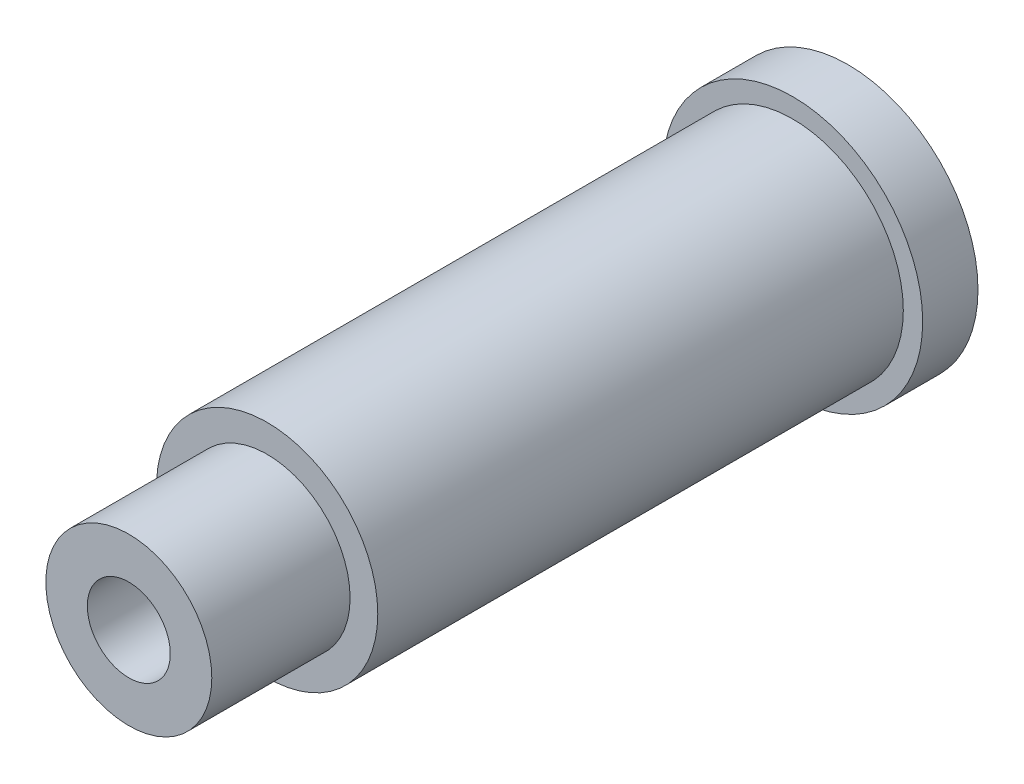
ISO-10303-21;
HEADER;
FILE_DESCRIPTION(('STEP AP214'),'2;1');
FILE_NAME('part.step','',(''),(''),'','','');
FILE_SCHEMA(('AUTOMOTIVE_DESIGN { 1 0 10303 214 1 1 1 1 }'));
ENDSEC;
DATA;
#1=APPLICATION_CONTEXT('core data for automotive mechanical design processes');
#2=APPLICATION_PROTOCOL_DEFINITION('international standard','automotive_design',2000,#1);
#3=PRODUCT_CONTEXT('',#1,'mechanical');
#4=PRODUCT('Part','Part','',(#3));
#5=PRODUCT_RELATED_PRODUCT_CATEGORY('part','',(#4));
#6=PRODUCT_DEFINITION_FORMATION('','',#4);
#7=PRODUCT_DEFINITION_CONTEXT('part definition',#1,'design');
#8=PRODUCT_DEFINITION('design','',#6,#7);
#9=PRODUCT_DEFINITION_SHAPE('','',#8);
#10=(LENGTH_UNIT() NAMED_UNIT(*) SI_UNIT(.MILLI.,.METRE.));
#11=(NAMED_UNIT(*) PLANE_ANGLE_UNIT() SI_UNIT($,.RADIAN.));
#12=(NAMED_UNIT(*) SI_UNIT($,.STERADIAN.) SOLID_ANGLE_UNIT());
#13=UNCERTAINTY_MEASURE_WITH_UNIT(LENGTH_MEASURE(1.E-05),#10,'distance_accuracy_value','');
#14=(GEOMETRIC_REPRESENTATION_CONTEXT(3) GLOBAL_UNCERTAINTY_ASSIGNED_CONTEXT((#13)) GLOBAL_UNIT_ASSIGNED_CONTEXT((#10,
#11,#12)) REPRESENTATION_CONTEXT('',''));
#15=CARTESIAN_POINT('',(0.,0.,0.));
#16=DIRECTION('',(0.,0.,1.));
#17=DIRECTION('',(1.,0.,0.));
#18=AXIS2_PLACEMENT_3D('',#15,#16,#17);
#19=CARTESIAN_POINT('',(0.,0.,21.));
#20=DIRECTION('',(0.,0.,1.));
#21=DIRECTION('',(1.,0.,0.));
#22=AXIS2_PLACEMENT_3D('',#19,#20,#21);
#23=PLANE('',#22);
#24=CARTESIAN_POINT('',(0.,0.,21.));
#25=DIRECTION('',(0.,0.,1.));
#26=DIRECTION('',(1.,0.,0.));
#27=AXIS2_PLACEMENT_3D('',#24,#25,#26);
#28=CIRCLE('',#27,4.);
#29=CARTESIAN_POINT('',(4.,0.,21.));
#30=VERTEX_POINT('',#29);
#31=EDGE_CURVE('E38',#30,#30,#28,.T.);
#32=ORIENTED_EDGE('',*,*,#31,.T.);
#33=EDGE_LOOP('',(#32));
#34=FACE_BOUND('',#33,.T.);
#35=CARTESIAN_POINT('',(0.,0.,21.));
#36=DIRECTION('',(0.,0.,1.));
#37=DIRECTION('',(1.,0.,0.));
#38=AXIS2_PLACEMENT_3D('',#35,#36,#37);
#39=CIRCLE('',#38,3.);
#40=CARTESIAN_POINT('',(3.,0.,21.));
#41=VERTEX_POINT('',#40);
#42=EDGE_CURVE('E50',#41,#41,#39,.T.);
#43=ORIENTED_EDGE('',*,*,#42,.F.);
#44=EDGE_LOOP('',(#43));
#45=FACE_BOUND('',#44,.T.);
#46=ADVANCED_FACE('F27',(#34,#45),#23,.T.);
#47=CARTESIAN_POINT('',(0.,0.,2.));
#48=DIRECTION('',(0.,0.,1.));
#49=DIRECTION('',(1.,0.,0.));
#50=AXIS2_PLACEMENT_3D('',#47,#48,#49);
#51=PLANE('',#50);
#52=CARTESIAN_POINT('',(0.,0.,2.));
#53=DIRECTION('',(0.,0.,1.));
#54=DIRECTION('',(1.,0.,0.));
#55=AXIS2_PLACEMENT_3D('',#52,#53,#54);
#56=CIRCLE('',#55,4.7);
#57=CARTESIAN_POINT('',(4.7,0.,2.));
#58=VERTEX_POINT('',#57);
#59=EDGE_CURVE('E10',#58,#58,#56,.T.);
#60=ORIENTED_EDGE('',*,*,#59,.T.);
#61=EDGE_LOOP('',(#60));
#62=FACE_BOUND('',#61,.T.);
#63=CARTESIAN_POINT('',(0.,0.,2.));
#64=DIRECTION('',(0.,0.,1.));
#65=DIRECTION('',(1.,0.,0.));
#66=AXIS2_PLACEMENT_3D('',#63,#64,#65);
#67=CIRCLE('',#66,4.);
#68=CARTESIAN_POINT('',(4.,0.,2.));
#69=VERTEX_POINT('',#68);
#70=EDGE_CURVE('E42',#69,#69,#67,.T.);
#71=ORIENTED_EDGE('',*,*,#70,.F.);
#72=EDGE_LOOP('',(#71));
#73=FACE_BOUND('',#72,.T.);
#74=ADVANCED_FACE('F74',(#62,#73),#51,.T.);
#75=CARTESIAN_POINT('',(0.,0.,2.));
#76=DIRECTION('',(0.,0.,-1.));
#77=DIRECTION('',(-1.,0.,0.));
#78=AXIS2_PLACEMENT_3D('',#75,#76,#77);
#79=CYLINDRICAL_SURFACE('',#78,4.7);
#80=ORIENTED_EDGE('',*,*,#59,.F.);
#81=EDGE_LOOP('',(#80));
#82=FACE_BOUND('',#81,.T.);
#83=CARTESIAN_POINT('',(0.,0.,0.));
#84=DIRECTION('',(0.,0.,1.));
#85=DIRECTION('',(1.,0.,0.));
#86=AXIS2_PLACEMENT_3D('',#83,#84,#85);
#87=CIRCLE('',#86,4.7);
#88=CARTESIAN_POINT('',(4.7,0.,0.));
#89=VERTEX_POINT('',#88);
#90=EDGE_CURVE('E34',#89,#89,#87,.T.);
#91=ORIENTED_EDGE('',*,*,#90,.T.);
#92=EDGE_LOOP('',(#91));
#93=FACE_BOUND('',#92,.T.);
#94=ADVANCED_FACE('F29',(#82,#93),#79,.T.);
#95=CARTESIAN_POINT('',(0.,0.,0.));
#96=DIRECTION('',(0.,0.,1.));
#97=DIRECTION('',(1.,0.,0.));
#98=AXIS2_PLACEMENT_3D('',#95,#96,#97);
#99=PLANE('',#98);
#100=CARTESIAN_POINT('',(0.,0.,0.));
#101=DIRECTION('',(0.,0.,-1.));
#102=DIRECTION('',(-1.,0.,0.));
#103=AXIS2_PLACEMENT_3D('',#100,#101,#102);
#104=CIRCLE('',#103,1.5);
#105=CARTESIAN_POINT('',(-1.5,0.,0.));
#106=VERTEX_POINT('',#105);
#107=EDGE_CURVE('E56',#106,#106,#104,.T.);
#108=ORIENTED_EDGE('',*,*,#107,.F.);
#109=EDGE_LOOP('',(#108));
#110=FACE_BOUND('',#109,.T.);
#111=ORIENTED_EDGE('',*,*,#90,.F.);
#112=EDGE_LOOP('',(#111));
#113=FACE_BOUND('',#112,.T.);
#114=ADVANCED_FACE('F62',(#110,#113),#99,.F.);
#115=CARTESIAN_POINT('',(0.,0.,21.));
#116=DIRECTION('',(0.,0.,-1.));
#117=DIRECTION('',(-1.,0.,0.));
#118=AXIS2_PLACEMENT_3D('',#115,#116,#117);
#119=CYLINDRICAL_SURFACE('',#118,4.);
#120=ORIENTED_EDGE('',*,*,#31,.F.);
#121=EDGE_LOOP('',(#120));
#122=FACE_BOUND('',#121,.T.);
#123=ORIENTED_EDGE('',*,*,#70,.T.);
#124=EDGE_LOOP('',(#123));
#125=FACE_BOUND('',#124,.T.);
#126=ADVANCED_FACE('F65',(#122,#125),#119,.T.);
#127=CARTESIAN_POINT('',(0.,0.,26.));
#128=DIRECTION('',(0.,0.,-1.));
#129=DIRECTION('',(-1.,0.,0.));
#130=AXIS2_PLACEMENT_3D('',#127,#128,#129);
#131=CYLINDRICAL_SURFACE('',#130,3.);
#132=CARTESIAN_POINT('',(0.,0.,26.));
#133=DIRECTION('',(0.,0.,1.));
#134=DIRECTION('',(1.,0.,0.));
#135=AXIS2_PLACEMENT_3D('',#132,#133,#134);
#136=CIRCLE('',#135,3.);
#137=CARTESIAN_POINT('',(3.,0.,26.));
#138=VERTEX_POINT('',#137);
#139=EDGE_CURVE('E47',#138,#138,#136,.T.);
#140=ORIENTED_EDGE('',*,*,#139,.F.);
#141=EDGE_LOOP('',(#140));
#142=FACE_BOUND('',#141,.T.);
#143=ORIENTED_EDGE('',*,*,#42,.T.);
#144=EDGE_LOOP('',(#143));
#145=FACE_BOUND('',#144,.T.);
#146=ADVANCED_FACE('F71',(#142,#145),#131,.T.);
#147=CARTESIAN_POINT('',(0.,0.,26.));
#148=DIRECTION('',(0.,0.,1.));
#149=DIRECTION('',(1.,0.,0.));
#150=AXIS2_PLACEMENT_3D('',#147,#148,#149);
#151=PLANE('',#150);
#152=CARTESIAN_POINT('',(0.,0.,26.));
#153=DIRECTION('',(0.,0.,-1.));
#154=DIRECTION('',(-1.,0.,0.));
#155=AXIS2_PLACEMENT_3D('',#152,#153,#154);
#156=CIRCLE('',#155,1.5);
#157=CARTESIAN_POINT('',(-1.5,0.,26.));
#158=VERTEX_POINT('',#157);
#159=EDGE_CURVE('E53',#158,#158,#156,.T.);
#160=ORIENTED_EDGE('',*,*,#159,.T.);
#161=EDGE_LOOP('',(#160));
#162=FACE_BOUND('',#161,.T.);
#163=ORIENTED_EDGE('',*,*,#139,.T.);
#164=EDGE_LOOP('',(#163));
#165=FACE_BOUND('',#164,.T.);
#166=ADVANCED_FACE('F86',(#162,#165),#151,.T.);
#167=CARTESIAN_POINT('',(0.,0.,26.));
#168=DIRECTION('',(0.,0.,-1.));
#169=DIRECTION('',(-1.,0.,0.));
#170=AXIS2_PLACEMENT_3D('',#167,#168,#169);
#171=CYLINDRICAL_SURFACE('',#170,1.5);
#172=ORIENTED_EDGE('',*,*,#159,.F.);
#173=EDGE_LOOP('',(#172));
#174=FACE_BOUND('',#173,.T.);
#175=ORIENTED_EDGE('',*,*,#107,.T.);
#176=EDGE_LOOP('',(#175));
#177=FACE_BOUND('',#176,.T.);
#178=ADVANCED_FACE('F60',(#174,#177),#171,.F.);
#179=CLOSED_SHELL('',(#46,#74,#94,#114,#126,#146,#166,#178));
#180=MANIFOLD_SOLID_BREP('B2',#179);
#181=ADVANCED_BREP_SHAPE_REPRESENTATION('',(#18,#180),#14);
#182=SHAPE_DEFINITION_REPRESENTATION(#9,#181);
ENDSEC;
END-ISO-10303-21;
